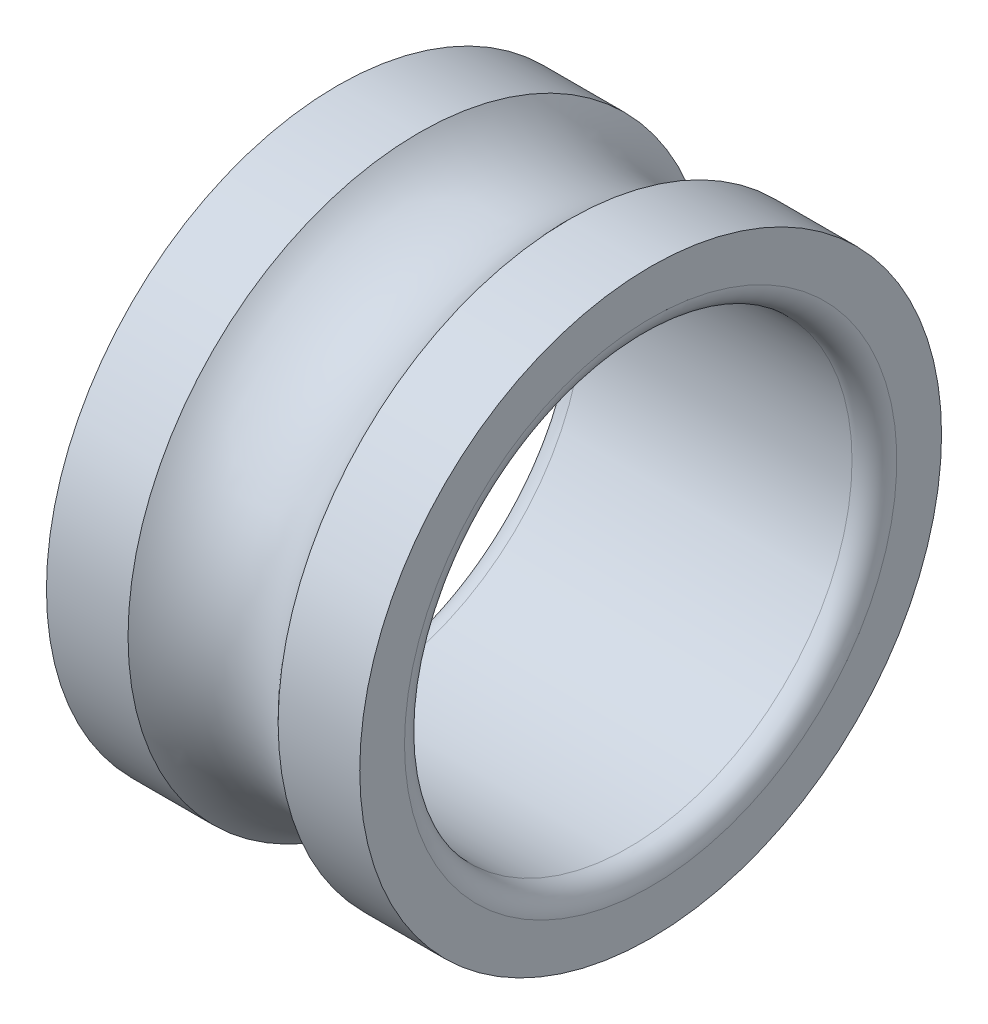
ISO-10303-21;
HEADER;
FILE_DESCRIPTION(('STEP AP214'),'2;1');
FILE_NAME('part.step','',(''),(''),'','','');
FILE_SCHEMA(('AUTOMOTIVE_DESIGN { 1 0 10303 214 1 1 1 1 }'));
ENDSEC;
DATA;
#1=APPLICATION_CONTEXT('core data for automotive mechanical design processes');
#2=APPLICATION_PROTOCOL_DEFINITION('international standard','automotive_design',2000,#1);
#3=PRODUCT_CONTEXT('',#1,'mechanical');
#4=PRODUCT('Part','Part','',(#3));
#5=PRODUCT_RELATED_PRODUCT_CATEGORY('part','',(#4));
#6=PRODUCT_DEFINITION_FORMATION('','',#4);
#7=PRODUCT_DEFINITION_CONTEXT('part definition',#1,'design');
#8=PRODUCT_DEFINITION('design','',#6,#7);
#9=PRODUCT_DEFINITION_SHAPE('','',#8);
#10=(LENGTH_UNIT() NAMED_UNIT(*) SI_UNIT(.MILLI.,.METRE.));
#11=(NAMED_UNIT(*) PLANE_ANGLE_UNIT() SI_UNIT($,.RADIAN.));
#12=(NAMED_UNIT(*) SI_UNIT($,.STERADIAN.) SOLID_ANGLE_UNIT());
#13=UNCERTAINTY_MEASURE_WITH_UNIT(LENGTH_MEASURE(1.E-05),#10,'distance_accuracy_value','');
#14=(GEOMETRIC_REPRESENTATION_CONTEXT(3) GLOBAL_UNCERTAINTY_ASSIGNED_CONTEXT((#13)) GLOBAL_UNIT_ASSIGNED_CONTEXT((#10,
#11,#12)) REPRESENTATION_CONTEXT('',''));
#15=CARTESIAN_POINT('',(0.,0.,0.));
#16=DIRECTION('',(0.,0.,1.));
#17=DIRECTION('',(1.,0.,0.));
#18=AXIS2_PLACEMENT_3D('',#15,#16,#17);
#19=CARTESIAN_POINT('',(3.5,5.,0.));
#20=DIRECTION('',(-1.,0.,0.));
#21=DIRECTION('',(0.,0.,1.));
#22=AXIS2_PLACEMENT_3D('',#19,#20,#21);
#23=PLANE('',#22);
#24=CARTESIAN_POINT('',(3.5,0.,0.));
#25=DIRECTION('',(-1.,0.,0.));
#26=DIRECTION('',(0.,0.,1.));
#27=AXIS2_PLACEMENT_3D('',#24,#25,#26);
#28=CIRCLE('',#27,5.5);
#29=CARTESIAN_POINT('',(3.5,0.,5.5));
#30=VERTEX_POINT('',#29);
#31=EDGE_CURVE('E10',#30,#30,#28,.T.);
#32=ORIENTED_EDGE('',*,*,#31,.T.);
#33=EDGE_LOOP('',(#32));
#34=FACE_BOUND('',#33,.T.);
#35=CARTESIAN_POINT('',(3.5,0.,0.));
#36=DIRECTION('',(-1.,0.,0.));
#37=DIRECTION('',(0.,0.,1.));
#38=AXIS2_PLACEMENT_3D('',#35,#36,#37);
#39=CIRCLE('',#38,6.5);
#40=CARTESIAN_POINT('',(3.5,0.,6.5));
#41=VERTEX_POINT('',#40);
#42=EDGE_CURVE('E63',#41,#41,#39,.T.);
#43=ORIENTED_EDGE('',*,*,#42,.F.);
#44=EDGE_LOOP('',(#43));
#45=FACE_BOUND('',#44,.T.);
#46=ADVANCED_FACE('F39',(#34,#45),#23,.F.);
#47=CARTESIAN_POINT('',(-42.3909297052154,0.,0.));
#48=DIRECTION('',(-1.,0.,0.));
#49=DIRECTION('',(0.,0.,1.));
#50=AXIS2_PLACEMENT_3D('',#47,#48,#49);
#51=CYLINDRICAL_SURFACE('',#50,6.5);
#52=CARTESIAN_POINT('',(1.67705098312484,0.,0.));
#53=DIRECTION('',(-1.,0.,0.));
#54=DIRECTION('',(0.,0.,1.));
#55=AXIS2_PLACEMENT_3D('',#52,#53,#54);
#56=CIRCLE('',#55,6.5);
#57=CARTESIAN_POINT('',(1.67705098312484,0.,6.5));
#58=VERTEX_POINT('',#57);
#59=EDGE_CURVE('E67',#58,#58,#56,.T.);
#60=ORIENTED_EDGE('',*,*,#59,.F.);
#61=EDGE_LOOP('',(#60));
#62=FACE_BOUND('',#61,.T.);
#63=ORIENTED_EDGE('',*,*,#42,.T.);
#64=EDGE_LOOP('',(#63));
#65=FACE_BOUND('',#64,.T.);
#66=ADVANCED_FACE('F91',(#62,#65),#51,.T.);
#67=CARTESIAN_POINT('',(0.,0.,0.));
#68=DIRECTION('',(-1.,0.,0.));
#69=DIRECTION('',(0.,0.,1.));
#70=AXIS2_PLACEMENT_3D('',#67,#68,#69);
#71=TOROIDAL_SURFACE('',#70,8.,2.25);
#72=CARTESIAN_POINT('',(-1.67705098312484,0.,0.));
#73=DIRECTION('',(-1.,0.,0.));
#74=DIRECTION('',(0.,0.,1.));
#75=AXIS2_PLACEMENT_3D('',#72,#73,#74);
#76=CIRCLE('',#75,6.5);
#77=CARTESIAN_POINT('',(-1.67705098312484,0.,6.5));
#78=VERTEX_POINT('',#77);
#79=EDGE_CURVE('E71',#78,#78,#76,.T.);
#80=ORIENTED_EDGE('',*,*,#79,.F.);
#81=EDGE_LOOP('',(#80));
#82=FACE_BOUND('',#81,.T.);
#83=ORIENTED_EDGE('',*,*,#59,.T.);
#84=EDGE_LOOP('',(#83));
#85=FACE_BOUND('',#84,.T.);
#86=ADVANCED_FACE('F85',(#82,#85),#71,.F.);
#87=CARTESIAN_POINT('',(-42.3909297052154,0.,0.));
#88=DIRECTION('',(-1.,0.,0.));
#89=DIRECTION('',(0.,0.,1.));
#90=AXIS2_PLACEMENT_3D('',#87,#88,#89);
#91=CYLINDRICAL_SURFACE('',#90,6.5);
#92=CARTESIAN_POINT('',(-3.5,0.,0.));
#93=DIRECTION('',(-1.,0.,0.));
#94=DIRECTION('',(0.,0.,1.));
#95=AXIS2_PLACEMENT_3D('',#92,#93,#94);
#96=CIRCLE('',#95,6.5);
#97=CARTESIAN_POINT('',(-3.5,0.,6.5));
#98=VERTEX_POINT('',#97);
#99=EDGE_CURVE('E75',#98,#98,#96,.T.);
#100=ORIENTED_EDGE('',*,*,#99,.F.);
#101=EDGE_LOOP('',(#100));
#102=FACE_BOUND('',#101,.T.);
#103=ORIENTED_EDGE('',*,*,#79,.T.);
#104=EDGE_LOOP('',(#103));
#105=FACE_BOUND('',#104,.T.);
#106=ADVANCED_FACE('F82',(#102,#105),#91,.T.);
#107=CARTESIAN_POINT('',(-3.5,5.,0.));
#108=DIRECTION('',(1.,0.,0.));
#109=DIRECTION('',(0.,0.,-1.));
#110=AXIS2_PLACEMENT_3D('',#107,#108,#109);
#111=PLANE('',#110);
#112=CARTESIAN_POINT('',(-3.5,0.,0.));
#113=DIRECTION('',(1.,0.,0.));
#114=DIRECTION('',(0.,0.,-1.));
#115=AXIS2_PLACEMENT_3D('',#112,#113,#114);
#116=CIRCLE('',#115,5.5);
#117=CARTESIAN_POINT('',(-3.5,0.,-5.5));
#118=VERTEX_POINT('',#117);
#119=EDGE_CURVE('E47',#118,#118,#116,.T.);
#120=ORIENTED_EDGE('',*,*,#119,.T.);
#121=EDGE_LOOP('',(#120));
#122=FACE_BOUND('',#121,.T.);
#123=ORIENTED_EDGE('',*,*,#99,.T.);
#124=EDGE_LOOP('',(#123));
#125=FACE_BOUND('',#124,.T.);
#126=ADVANCED_FACE('F80',(#122,#125),#111,.F.);
#127=CARTESIAN_POINT('',(-42.3909297052154,0.,0.));
#128=DIRECTION('',(-1.,0.,0.));
#129=DIRECTION('',(0.,0.,1.));
#130=AXIS2_PLACEMENT_3D('',#127,#128,#129);
#131=CYLINDRICAL_SURFACE('',#130,5.);
#132=CARTESIAN_POINT('',(-3.,0.,0.));
#133=DIRECTION('',(1.,0.,0.));
#134=DIRECTION('',(0.,0.,-1.));
#135=AXIS2_PLACEMENT_3D('',#132,#133,#134);
#136=CIRCLE('',#135,5.);
#137=CARTESIAN_POINT('',(-3.,0.,-5.));
#138=VERTEX_POINT('',#137);
#139=EDGE_CURVE('E52',#138,#138,#136,.F.);
#140=ORIENTED_EDGE('',*,*,#139,.T.);
#141=EDGE_LOOP('',(#140));
#142=FACE_BOUND('',#141,.T.);
#143=CARTESIAN_POINT('',(3.,0.,0.));
#144=DIRECTION('',(-1.,0.,0.));
#145=DIRECTION('',(0.,0.,1.));
#146=AXIS2_PLACEMENT_3D('',#143,#144,#145);
#147=CIRCLE('',#146,5.);
#148=CARTESIAN_POINT('',(3.,0.,5.));
#149=VERTEX_POINT('',#148);
#150=EDGE_CURVE('E57',#149,#149,#147,.F.);
#151=ORIENTED_EDGE('',*,*,#150,.T.);
#152=EDGE_LOOP('',(#151));
#153=FACE_BOUND('',#152,.T.);
#154=ADVANCED_FACE('F106',(#142,#153),#131,.F.);
#155=CARTESIAN_POINT('',(-3.,0.,0.));
#156=DIRECTION('',(1.,0.,0.));
#157=DIRECTION('',(0.,0.,-1.));
#158=AXIS2_PLACEMENT_3D('',#155,#156,#157);
#159=TOROIDAL_SURFACE('',#158,5.5,0.5);
#160=ORIENTED_EDGE('',*,*,#119,.F.);
#161=EDGE_LOOP('',(#160));
#162=FACE_BOUND('',#161,.T.);
#163=ORIENTED_EDGE('',*,*,#139,.F.);
#164=EDGE_LOOP('',(#163));
#165=FACE_BOUND('',#164,.T.);
#166=ADVANCED_FACE('F104',(#162,#165),#159,.T.);
#167=CARTESIAN_POINT('',(3.,0.,0.));
#168=DIRECTION('',(-1.,0.,0.));
#169=DIRECTION('',(0.,0.,1.));
#170=AXIS2_PLACEMENT_3D('',#167,#168,#169);
#171=TOROIDAL_SURFACE('',#170,5.5,0.5);
#172=ORIENTED_EDGE('',*,*,#150,.F.);
#173=EDGE_LOOP('',(#172));
#174=FACE_BOUND('',#173,.T.);
#175=ORIENTED_EDGE('',*,*,#31,.F.);
#176=EDGE_LOOP('',(#175));
#177=FACE_BOUND('',#176,.T.);
#178=ADVANCED_FACE('F41',(#174,#177),#171,.T.);
#179=CLOSED_SHELL('',(#46,#66,#86,#106,#126,#154,#166,#178));
#180=MANIFOLD_SOLID_BREP('B2',#179);
#181=ADVANCED_BREP_SHAPE_REPRESENTATION('',(#18,#180),#14);
#182=SHAPE_DEFINITION_REPRESENTATION(#9,#181);
ENDSEC;
END-ISO-10303-21;
